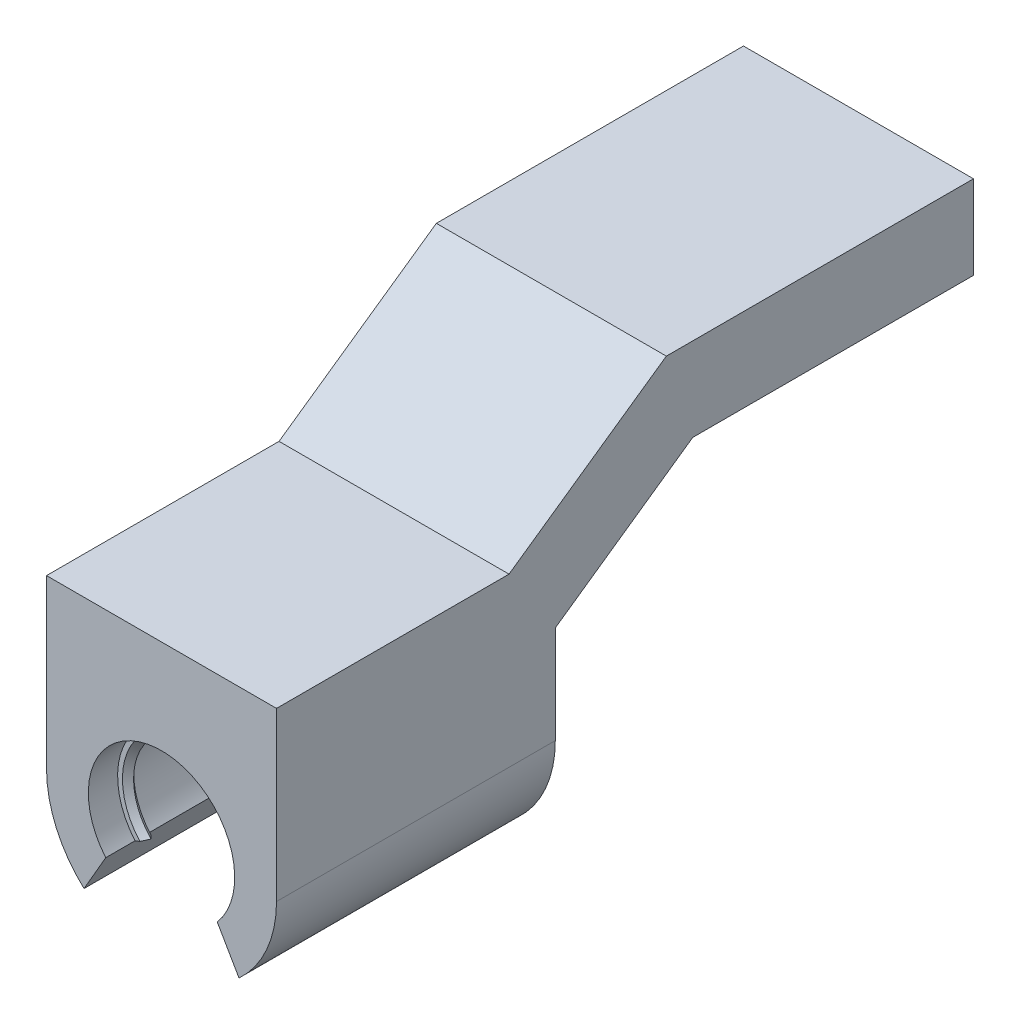
ISO-10303-21;
HEADER;
FILE_DESCRIPTION(('STEP AP214'),'2;1');
FILE_NAME('part.step','',(''),(''),'','','');
FILE_SCHEMA(('AUTOMOTIVE_DESIGN { 1 0 10303 214 1 1 1 1 }'));
ENDSEC;
DATA;
#1=APPLICATION_CONTEXT('core data for automotive mechanical design processes');
#2=APPLICATION_PROTOCOL_DEFINITION('international standard','automotive_design',2000,#1);
#3=PRODUCT_CONTEXT('',#1,'mechanical');
#4=PRODUCT('Part','Part','',(#3));
#5=PRODUCT_RELATED_PRODUCT_CATEGORY('part','',(#4));
#6=PRODUCT_DEFINITION_FORMATION('','',#4);
#7=PRODUCT_DEFINITION_CONTEXT('part definition',#1,'design');
#8=PRODUCT_DEFINITION('design','',#6,#7);
#9=PRODUCT_DEFINITION_SHAPE('','',#8);
#10=(LENGTH_UNIT() NAMED_UNIT(*) SI_UNIT(.MILLI.,.METRE.));
#11=(NAMED_UNIT(*) PLANE_ANGLE_UNIT() SI_UNIT($,.RADIAN.));
#12=(NAMED_UNIT(*) SI_UNIT($,.STERADIAN.) SOLID_ANGLE_UNIT());
#13=UNCERTAINTY_MEASURE_WITH_UNIT(LENGTH_MEASURE(1.E-05),#10,'distance_accuracy_value','');
#14=(GEOMETRIC_REPRESENTATION_CONTEXT(3) GLOBAL_UNCERTAINTY_ASSIGNED_CONTEXT((#13)) GLOBAL_UNIT_ASSIGNED_CONTEXT((#10,
#11,#12)) REPRESENTATION_CONTEXT('',''));
#15=CARTESIAN_POINT('',(0.,0.,0.));
#16=DIRECTION('',(0.,0.,1.));
#17=DIRECTION('',(1.,0.,0.));
#18=AXIS2_PLACEMENT_3D('',#15,#16,#17);
#19=CARTESIAN_POINT('',(0.,0.,20.));
#20=DIRECTION('',(0.,0.,-1.));
#21=DIRECTION('',(-1.,0.,0.));
#22=AXIS2_PLACEMENT_3D('',#19,#20,#21);
#23=CYLINDRICAL_SURFACE('',#22,5.25);
#24=DIRECTION('',(0.,0.,-1.));
#25=VECTOR('',#24,1.);
#26=CARTESIAN_POINT('',(-4.,-3.40036762718386,20.));
#27=LINE('',#26,#25);
#28=CARTESIAN_POINT('',(-4.,-3.40036762718386,20.));
#29=VERTEX_POINT('',#28);
#30=CARTESIAN_POINT('',(-4.,-3.40036762718386,17.9));
#31=VERTEX_POINT('',#30);
#32=EDGE_CURVE('E233',#29,#31,#27,.T.);
#33=ORIENTED_EDGE('',*,*,#32,.T.);
#34=CARTESIAN_POINT('',(0.,0.,17.9));
#35=DIRECTION('',(0.,0.,-1.));
#36=DIRECTION('',(-1.,0.,0.));
#37=AXIS2_PLACEMENT_3D('',#34,#35,#36);
#38=CIRCLE('',#37,5.25);
#39=CARTESIAN_POINT('',(4.,-3.40036762718386,17.9));
#40=VERTEX_POINT('',#39);
#41=EDGE_CURVE('E383',#31,#40,#38,.T.);
#42=ORIENTED_EDGE('',*,*,#41,.T.);
#43=DIRECTION('',(0.,0.,-1.));
#44=VECTOR('',#43,1.);
#45=CARTESIAN_POINT('',(4.,-3.40036762718386,20.));
#46=LINE('',#45,#44);
#47=CARTESIAN_POINT('',(4.,-3.40036762718386,20.));
#48=VERTEX_POINT('',#47);
#49=EDGE_CURVE('E255',#48,#40,#46,.T.);
#50=ORIENTED_EDGE('',*,*,#49,.F.);
#51=CARTESIAN_POINT('',(0.,0.,20.));
#52=DIRECTION('',(0.,0.,-1.));
#53=DIRECTION('',(1.,0.,0.));
#54=AXIS2_PLACEMENT_3D('',#51,#52,#53);
#55=CIRCLE('',#54,5.25);
#56=EDGE_CURVE('E232',#29,#48,#55,.T.);
#57=ORIENTED_EDGE('',*,*,#56,.F.);
#58=EDGE_LOOP('',(#33,#42,#50,#57));
#59=FACE_BOUND('',#58,.T.);
#60=ADVANCED_FACE('F33',(#59),#23,.F.);
#61=CARTESIAN_POINT('',(4.,-3.40036762718386,2.1));
#62=VERTEX_POINT('',#61);
#63=CARTESIAN_POINT('',(4.,-3.40036762718386,0.));
#64=VERTEX_POINT('',#63);
#65=EDGE_CURVE('E254',#62,#64,#46,.T.);
#66=ORIENTED_EDGE('',*,*,#65,.F.);
#67=CARTESIAN_POINT('',(0.,0.,2.1));
#68=DIRECTION('',(0.,0.,-1.));
#69=DIRECTION('',(-1.,0.,0.));
#70=AXIS2_PLACEMENT_3D('',#67,#68,#69);
#71=CIRCLE('',#70,5.25);
#72=CARTESIAN_POINT('',(-3.99999999999995,-3.40036762718392,2.1));
#73=VERTEX_POINT('',#72);
#74=EDGE_CURVE('E401',#73,#62,#71,.T.);
#75=ORIENTED_EDGE('',*,*,#74,.F.);
#76=CARTESIAN_POINT('',(-4.,-3.40036762718386,0.));
#77=VERTEX_POINT('',#76);
#78=EDGE_CURVE('E238',#73,#77,#27,.T.);
#79=ORIENTED_EDGE('',*,*,#78,.T.);
#80=CARTESIAN_POINT('',(0.,0.,0.));
#81=DIRECTION('',(0.,0.,-1.));
#82=DIRECTION('',(1.,0.,0.));
#83=AXIS2_PLACEMENT_3D('',#80,#81,#82);
#84=CIRCLE('',#83,5.25);
#85=EDGE_CURVE('E407',#77,#64,#84,.T.);
#86=ORIENTED_EDGE('',*,*,#85,.T.);
#87=EDGE_LOOP('',(#66,#75,#79,#86));
#88=FACE_BOUND('',#87,.T.);
#89=ADVANCED_FACE('F472',(#88),#23,.F.);
#90=CARTESIAN_POINT('',(4.,-3.40036762718386,17.1));
#91=VERTEX_POINT('',#90);
#92=CARTESIAN_POINT('',(4.,-3.40036762718386,2.9));
#93=VERTEX_POINT('',#92);
#94=EDGE_CURVE('E259',#91,#93,#46,.T.);
#95=ORIENTED_EDGE('',*,*,#94,.F.);
#96=CARTESIAN_POINT('',(0.,0.,17.1));
#97=DIRECTION('',(0.,0.,-1.));
#98=DIRECTION('',(-1.,0.,0.));
#99=AXIS2_PLACEMENT_3D('',#96,#97,#98);
#100=CIRCLE('',#99,5.25);
#101=CARTESIAN_POINT('',(-3.99999999999995,-3.40036762718392,17.1));
#102=VERTEX_POINT('',#101);
#103=EDGE_CURVE('E385',#102,#91,#100,.T.);
#104=ORIENTED_EDGE('',*,*,#103,.F.);
#105=CARTESIAN_POINT('',(-4.,-3.40036762718386,2.9));
#106=VERTEX_POINT('',#105);
#107=EDGE_CURVE('E237',#102,#106,#27,.T.);
#108=ORIENTED_EDGE('',*,*,#107,.T.);
#109=CARTESIAN_POINT('',(0.,0.,2.9));
#110=DIRECTION('',(0.,0.,-1.));
#111=DIRECTION('',(-1.,0.,0.));
#112=AXIS2_PLACEMENT_3D('',#109,#110,#111);
#113=CIRCLE('',#112,5.25);
#114=EDGE_CURVE('E404',#106,#93,#113,.T.);
#115=ORIENTED_EDGE('',*,*,#114,.T.);
#116=EDGE_LOOP('',(#95,#104,#108,#115));
#117=FACE_BOUND('',#116,.T.);
#118=ADVANCED_FACE('F276',(#117),#23,.F.);
#119=CARTESIAN_POINT('',(5.55720970410094,-6.097533952726,20.));
#120=DIRECTION('',(0.86602540378444,0.499999999999998,0.));
#121=DIRECTION('',(-0.499999999999998,0.86602540378444,0.));
#122=AXIS2_PLACEMENT_3D('',#119,#120,#121);
#123=PLANE('',#122);
#124=CARTESIAN_POINT('',(3.8157755224296,-3.0812814720341,17.9));
#125=CARTESIAN_POINT('',(3.7799287899026,-3.01919311001199,17.8330833661077));
#126=CARTESIAN_POINT('',(3.74402413241946,-2.95700441902284,17.766291720092));
#127=CARTESIAN_POINT('',(3.67209895830601,-2.8324263631151,17.6329583866945));
#128=CARTESIAN_POINT('',(3.63607844164595,-2.77003699814499,17.5664166993768));
#129=CARTESIAN_POINT('',(3.6,-2.70754730415631,17.5));
#130=B_SPLINE_CURVE_WITH_KNOTS('',3,(#124,#125,#126,#127,#128,#129),.UNSPECIFIED.,.F.,.F.,(4,2,
4),(0.,0.294209645050404,0.588419365651553),.UNSPECIFIED.);
#131=CARTESIAN_POINT('',(3.8157755224296,-3.0812814720341,17.9));
#132=VERTEX_POINT('',#131);
#133=CARTESIAN_POINT('',(3.6,-2.70754730415631,17.5));
#134=VERTEX_POINT('',#133);
#135=EDGE_CURVE('E284',#132,#134,#130,.T.);
#136=ORIENTED_EDGE('',*,*,#135,.T.);
#137=CARTESIAN_POINT('',(3.6,-2.70754730415631,17.5));
#138=CARTESIAN_POINT('',(3.63607844164595,-2.770036998145,17.4335833006232));
#139=CARTESIAN_POINT('',(3.67209895830601,-2.8324263631151,17.3670416133055));
#140=CARTESIAN_POINT('',(3.74402413241946,-2.95700441902284,17.233708279908));
#141=CARTESIAN_POINT('',(3.7799287899026,-3.01919311001199,17.1669166338923));
#142=CARTESIAN_POINT('',(3.81577552242961,-3.0812814720341,17.1));
#143=B_SPLINE_CURVE_WITH_KNOTS('',3,(#137,#138,#139,#140,#141,#142),.UNSPECIFIED.,.F.,.F.,(4,2,
4),(0.,0.29420972060115,0.588419365651559),.UNSPECIFIED.);
#144=CARTESIAN_POINT('',(3.8157755224296,-3.0812814720341,17.1));
#145=VERTEX_POINT('',#144);
#146=EDGE_CURVE('E289',#134,#145,#143,.T.);
#147=ORIENTED_EDGE('',*,*,#146,.T.);
#148=DIRECTION('',(0.499999999999998,-0.86602540378444,0.));
#149=VECTOR('',#148,1.);
#150=CARTESIAN_POINT('',(4.,-3.40036762718386,17.1));
#151=LINE('',#150,#149);
#152=EDGE_CURVE('E356',#145,#91,#151,.T.);
#153=ORIENTED_EDGE('',*,*,#152,.T.);
#154=ORIENTED_EDGE('',*,*,#94,.T.);
#155=DIRECTION('',(-0.499999999999998,0.86602540378444,0.));
#156=VECTOR('',#155,1.);
#157=CARTESIAN_POINT('',(4.,-3.40036762718386,2.9));
#158=LINE('',#157,#156);
#159=CARTESIAN_POINT('',(3.8157755224296,-3.0812814720341,2.9));
#160=VERTEX_POINT('',#159);
#161=EDGE_CURVE('E390',#93,#160,#158,.T.);
#162=ORIENTED_EDGE('',*,*,#161,.T.);
#163=CARTESIAN_POINT('',(3.8157755224296,-3.0812814720341,2.9));
#164=CARTESIAN_POINT('',(3.7799287899026,-3.01919311001199,2.83308336610767));
#165=CARTESIAN_POINT('',(3.74402413241946,-2.95700441902284,2.76629172009199));
#166=CARTESIAN_POINT('',(3.67209895830601,-2.8324263631151,2.63295838669446));
#167=CARTESIAN_POINT('',(3.63607844164595,-2.77003699814499,2.56641669937681));
#168=CARTESIAN_POINT('',(3.6,-2.70754730415631,2.5));
#169=B_SPLINE_CURVE_WITH_KNOTS('',3,(#163,#164,#165,#166,#167,#168),.UNSPECIFIED.,.F.,.F.,(4,2,
4),(0.,0.294209645050408,0.588419365651558),.UNSPECIFIED.);
#170=CARTESIAN_POINT('',(3.6,-2.70754730415631,2.5));
#171=VERTEX_POINT('',#170);
#172=EDGE_CURVE('E265',#160,#171,#169,.T.);
#173=ORIENTED_EDGE('',*,*,#172,.T.);
#174=CARTESIAN_POINT('',(3.6,-2.70754730415631,2.5));
#175=CARTESIAN_POINT('',(3.63607844164595,-2.770036998145,2.43358330062319));
#176=CARTESIAN_POINT('',(3.67209895830601,-2.83242636311511,2.36704161330554));
#177=CARTESIAN_POINT('',(3.74402413241946,-2.95700441902284,2.23370827990801));
#178=CARTESIAN_POINT('',(3.7799287899026,-3.019193110012,2.16691663389234));
#179=CARTESIAN_POINT('',(3.81577552242961,-3.0812814720341,2.1));
#180=B_SPLINE_CURVE_WITH_KNOTS('',3,(#174,#175,#176,#177,#178,#179),.UNSPECIFIED.,.F.,.F.,(4,2,
4),(0.,0.294209720601152,0.58841936565156),.UNSPECIFIED.);
#181=CARTESIAN_POINT('',(3.81577552242961,-3.0812814720341,2.1));
#182=VERTEX_POINT('',#181);
#183=EDGE_CURVE('E258',#171,#182,#180,.T.);
#184=ORIENTED_EDGE('',*,*,#183,.T.);
#185=DIRECTION('',(0.499999999999998,-0.86602540378444,0.));
#186=VECTOR('',#185,1.);
#187=CARTESIAN_POINT('',(4.,-3.40036762718386,2.1));
#188=LINE('',#187,#186);
#189=EDGE_CURVE('E388',#182,#62,#188,.T.);
#190=ORIENTED_EDGE('',*,*,#189,.T.);
#191=ORIENTED_EDGE('',*,*,#65,.T.);
#192=DIRECTION('',(0.499999999999998,-0.86602540378444,0.));
#193=VECTOR('',#192,1.);
#194=CARTESIAN_POINT('',(5.55720970410094,-6.097533952726,0.));
#195=LINE('',#194,#193);
#196=CARTESIAN_POINT('',(5.55720970410094,-6.097533952726,0.));
#197=VERTEX_POINT('',#196);
#198=EDGE_CURVE('E224',#64,#197,#195,.T.);
#199=ORIENTED_EDGE('',*,*,#198,.T.);
#200=DIRECTION('',(0.,0.,-1.));
#201=VECTOR('',#200,1.);
#202=CARTESIAN_POINT('',(5.55720970410094,-6.097533952726,20.));
#203=LINE('',#202,#201);
#204=CARTESIAN_POINT('',(5.55720970410094,-6.097533952726,20.));
#205=VERTEX_POINT('',#204);
#206=EDGE_CURVE('E251',#205,#197,#203,.T.);
#207=ORIENTED_EDGE('',*,*,#206,.F.);
#208=DIRECTION('',(0.499999999999998,-0.86602540378444,0.));
#209=VECTOR('',#208,1.);
#210=CARTESIAN_POINT('',(5.55720970410094,-6.097533952726,20.));
#211=LINE('',#210,#209);
#212=EDGE_CURVE('E410',#48,#205,#211,.T.);
#213=ORIENTED_EDGE('',*,*,#212,.F.);
#214=ORIENTED_EDGE('',*,*,#49,.T.);
#215=DIRECTION('',(-0.499999999999998,0.86602540378444,0.));
#216=VECTOR('',#215,1.);
#217=CARTESIAN_POINT('',(4.,-3.40036762718386,17.9));
#218=LINE('',#217,#216);
#219=EDGE_CURVE('E351',#40,#132,#218,.T.);
#220=ORIENTED_EDGE('',*,*,#219,.T.);
#221=EDGE_LOOP('',(#136,#147,#153,#154,#162,#173,#184,#190,#191,#199,#207,#213,#214,#220));
#222=FACE_BOUND('',#221,.T.);
#223=ADVANCED_FACE('F270',(#222),#123,.F.);
#224=CARTESIAN_POINT('',(0.,0.,20.));
#225=DIRECTION('',(0.,0.,-1.));
#226=DIRECTION('',(-1.,0.,0.));
#227=AXIS2_PLACEMENT_3D('',#224,#225,#226);
#228=CYLINDRICAL_SURFACE('',#227,8.25);
#229=CARTESIAN_POINT('',(0.,0.,0.));
#230=DIRECTION('',(0.,0.,1.));
#231=DIRECTION('',(1.,0.,0.));
#232=AXIS2_PLACEMENT_3D('',#229,#230,#231);
#233=CIRCLE('',#232,8.25);
#234=CARTESIAN_POINT('',(8.25,0.,0.));
#235=VERTEX_POINT('',#234);
#236=EDGE_CURVE('E220',#197,#235,#233,.T.);
#237=ORIENTED_EDGE('',*,*,#236,.T.);
#238=DIRECTION('',(0.,0.,-1.));
#239=VECTOR('',#238,1.);
#240=CARTESIAN_POINT('',(8.25,0.,20.));
#241=LINE('',#240,#239);
#242=CARTESIAN_POINT('',(8.25,0.,20.));
#243=VERTEX_POINT('',#242);
#244=EDGE_CURVE('E219',#243,#235,#241,.T.);
#245=ORIENTED_EDGE('',*,*,#244,.F.);
#246=CARTESIAN_POINT('',(0.,0.,20.));
#247=DIRECTION('',(0.,0.,1.));
#248=DIRECTION('',(1.,0.,0.));
#249=AXIS2_PLACEMENT_3D('',#246,#247,#248);
#250=CIRCLE('',#249,8.25);
#251=EDGE_CURVE('E412',#205,#243,#250,.T.);
#252=ORIENTED_EDGE('',*,*,#251,.F.);
#253=ORIENTED_EDGE('',*,*,#206,.T.);
#254=EDGE_LOOP('',(#237,#245,#252,#253));
#255=FACE_BOUND('',#254,.T.);
#256=ADVANCED_FACE('F275',(#255),#228,.T.);
#257=CARTESIAN_POINT('',(8.25,0.,20.));
#258=DIRECTION('',(-1.,0.,0.));
#259=DIRECTION('',(0.,0.,1.));
#260=AXIS2_PLACEMENT_3D('',#257,#258,#259);
#261=PLANE('',#260);
#262=DIRECTION('',(0.,0.573576436351047,-0.819152044288991));
#263=VECTOR('',#262,1.);
#264=CARTESIAN_POINT('',(8.25,12.,3.31994074001602));
#265=LINE('',#264,#263);
#266=CARTESIAN_POINT('',(8.25,12.,3.31994074001602));
#267=VERTEX_POINT('',#266);
#268=CARTESIAN_POINT('',(8.25,19.902466047274,-7.96595039374555));
#269=VERTEX_POINT('',#268);
#270=EDGE_CURVE('E201',#267,#269,#265,.T.);
#271=ORIENTED_EDGE('',*,*,#270,.F.);
#272=DIRECTION('',(0.,0.,-1.));
#273=VECTOR('',#272,1.);
#274=CARTESIAN_POINT('',(8.25,12.,20.));
#275=LINE('',#274,#273);
#276=CARTESIAN_POINT('',(8.25,12.,20.));
#277=VERTEX_POINT('',#276);
#278=EDGE_CURVE('E247',#277,#267,#275,.T.);
#279=ORIENTED_EDGE('',*,*,#278,.F.);
#280=DIRECTION('',(0.,1.,0.));
#281=VECTOR('',#280,1.);
#282=CARTESIAN_POINT('',(8.25,0.,20.));
#283=LINE('',#282,#281);
#284=EDGE_CURVE('E414',#243,#277,#283,.T.);
#285=ORIENTED_EDGE('',*,*,#284,.F.);
#286=ORIENTED_EDGE('',*,*,#244,.T.);
#287=DIRECTION('',(0.,1.,0.));
#288=VECTOR('',#287,1.);
#289=CARTESIAN_POINT('',(8.25,0.,0.));
#290=LINE('',#289,#288);
#291=CARTESIAN_POINT('',(8.25,7.,0.));
#292=VERTEX_POINT('',#291);
#293=EDGE_CURVE('E208',#235,#292,#290,.T.);
#294=ORIENTED_EDGE('',*,*,#293,.T.);
#295=DIRECTION('',(0.,-0.573576436351047,0.819152044288991));
#296=VECTOR('',#295,1.);
#297=CARTESIAN_POINT('',(8.25,13.902466047274,-9.85774312701946));
#298=LINE('',#297,#296);
#299=CARTESIAN_POINT('',(8.25,13.902466047274,-9.85774312701946));
#300=VERTEX_POINT('',#299);
#301=EDGE_CURVE('E191',#300,#292,#298,.T.);
#302=ORIENTED_EDGE('',*,*,#301,.F.);
#303=DIRECTION('',(0.,0.,1.));
#304=VECTOR('',#303,1.);
#305=CARTESIAN_POINT('',(8.25,13.902466047274,-30.));
#306=LINE('',#305,#304);
#307=CARTESIAN_POINT('',(8.25,13.902466047274,-30.));
#308=VERTEX_POINT('',#307);
#309=EDGE_CURVE('E212',#308,#300,#306,.T.);
#310=ORIENTED_EDGE('',*,*,#309,.F.);
#311=DIRECTION('',(0.,-1.,0.));
#312=VECTOR('',#311,1.);
#313=CARTESIAN_POINT('',(8.25,19.902466047274,-30.));
#314=LINE('',#313,#312);
#315=CARTESIAN_POINT('',(8.25,19.902466047274,-30.));
#316=VERTEX_POINT('',#315);
#317=EDGE_CURVE('E605',#316,#308,#314,.T.);
#318=ORIENTED_EDGE('',*,*,#317,.F.);
#319=DIRECTION('',(0.,0.,-1.));
#320=VECTOR('',#319,1.);
#321=CARTESIAN_POINT('',(8.25,19.902466047274,-7.96595039374555));
#322=LINE('',#321,#320);
#323=EDGE_CURVE('E603',#269,#316,#322,.T.);
#324=ORIENTED_EDGE('',*,*,#323,.F.);
#325=EDGE_LOOP('',(#271,#279,#285,#286,#294,#302,#310,#318,#324));
#326=FACE_BOUND('',#325,.T.);
#327=ADVANCED_FACE('F216',(#326),#261,.F.);
#328=CARTESIAN_POINT('',(-8.25,12.,20.));
#329=DIRECTION('',(0.,-1.,0.));
#330=DIRECTION('',(0.,0.,-1.));
#331=AXIS2_PLACEMENT_3D('',#328,#329,#330);
#332=PLANE('',#331);
#333=ORIENTED_EDGE('',*,*,#278,.T.);
#334=DIRECTION('',(-1.,0.,0.));
#335=VECTOR('',#334,1.);
#336=CARTESIAN_POINT('',(8.25,12.,3.31994074001602));
#337=LINE('',#336,#335);
#338=CARTESIAN_POINT('',(-8.25,12.,3.31994074001602));
#339=VERTEX_POINT('',#338);
#340=EDGE_CURVE('E211',#267,#339,#337,.T.);
#341=ORIENTED_EDGE('',*,*,#340,.T.);
#342=DIRECTION('',(0.,0.,-1.));
#343=VECTOR('',#342,1.);
#344=CARTESIAN_POINT('',(-8.25,12.,20.));
#345=LINE('',#344,#343);
#346=CARTESIAN_POINT('',(-8.25,12.,20.));
#347=VERTEX_POINT('',#346);
#348=EDGE_CURVE('E244',#347,#339,#345,.T.);
#349=ORIENTED_EDGE('',*,*,#348,.F.);
#350=DIRECTION('',(-1.,0.,0.));
#351=VECTOR('',#350,1.);
#352=CARTESIAN_POINT('',(-8.25,12.,20.));
#353=LINE('',#352,#351);
#354=EDGE_CURVE('E416',#277,#347,#353,.T.);
#355=ORIENTED_EDGE('',*,*,#354,.F.);
#356=EDGE_LOOP('',(#333,#341,#349,#355));
#357=FACE_BOUND('',#356,.T.);
#358=ADVANCED_FACE('F486',(#357),#332,.F.);
#359=CARTESIAN_POINT('',(-8.25,0.,20.));
#360=DIRECTION('',(1.,0.,0.));
#361=DIRECTION('',(0.,0.,-1.));
#362=AXIS2_PLACEMENT_3D('',#359,#360,#361);
#363=PLANE('',#362);
#364=ORIENTED_EDGE('',*,*,#348,.T.);
#365=DIRECTION('',(0.,0.573576436351047,-0.819152044288991));
#366=VECTOR('',#365,1.);
#367=CARTESIAN_POINT('',(-8.25,12.,3.31994074001602));
#368=LINE('',#367,#366);
#369=CARTESIAN_POINT('',(-8.25,19.902466047274,-7.96595039374555));
#370=VERTEX_POINT('',#369);
#371=EDGE_CURVE('E594',#339,#370,#368,.T.);
#372=ORIENTED_EDGE('',*,*,#371,.T.);
#373=DIRECTION('',(0.,0.,-1.));
#374=VECTOR('',#373,1.);
#375=CARTESIAN_POINT('',(-8.25,19.902466047274,-7.96595039374555));
#376=LINE('',#375,#374);
#377=CARTESIAN_POINT('',(-8.25,19.902466047274,-30.));
#378=VERTEX_POINT('',#377);
#379=EDGE_CURVE('E598',#370,#378,#376,.T.);
#380=ORIENTED_EDGE('',*,*,#379,.T.);
#381=DIRECTION('',(0.,-1.,0.));
#382=VECTOR('',#381,1.);
#383=CARTESIAN_POINT('',(-8.25,19.902466047274,-30.));
#384=LINE('',#383,#382);
#385=CARTESIAN_POINT('',(-8.25,13.902466047274,-30.));
#386=VERTEX_POINT('',#385);
#387=EDGE_CURVE('E612',#378,#386,#384,.T.);
#388=ORIENTED_EDGE('',*,*,#387,.T.);
#389=DIRECTION('',(0.,0.,1.));
#390=VECTOR('',#389,1.);
#391=CARTESIAN_POINT('',(-8.25,13.902466047274,-30.));
#392=LINE('',#391,#390);
#393=CARTESIAN_POINT('',(-8.25,13.902466047274,-9.85774312701946));
#394=VERTEX_POINT('',#393);
#395=EDGE_CURVE('E202',#386,#394,#392,.T.);
#396=ORIENTED_EDGE('',*,*,#395,.T.);
#397=DIRECTION('',(0.,-0.573576436351047,0.819152044288991));
#398=VECTOR('',#397,1.);
#399=CARTESIAN_POINT('',(-8.25,13.902466047274,-9.85774312701946));
#400=LINE('',#399,#398);
#401=CARTESIAN_POINT('',(-8.25,7.,0.));
#402=VERTEX_POINT('',#401);
#403=EDGE_CURVE('E51',#394,#402,#400,.T.);
#404=ORIENTED_EDGE('',*,*,#403,.T.);
#405=DIRECTION('',(0.,-1.,0.));
#406=VECTOR('',#405,1.);
#407=CARTESIAN_POINT('',(-8.25,0.,0.));
#408=LINE('',#407,#406);
#409=CARTESIAN_POINT('',(-8.25,0.,0.));
#410=VERTEX_POINT('',#409);
#411=EDGE_CURVE('E210',#402,#410,#408,.T.);
#412=ORIENTED_EDGE('',*,*,#411,.T.);
#413=DIRECTION('',(0.,0.,-1.));
#414=VECTOR('',#413,1.);
#415=CARTESIAN_POINT('',(-8.25,0.,20.));
#416=LINE('',#415,#414);
#417=CARTESIAN_POINT('',(-8.25,0.,20.));
#418=VERTEX_POINT('',#417);
#419=EDGE_CURVE('E241',#418,#410,#416,.T.);
#420=ORIENTED_EDGE('',*,*,#419,.F.);
#421=DIRECTION('',(0.,-1.,0.));
#422=VECTOR('',#421,1.);
#423=CARTESIAN_POINT('',(-8.25,0.,20.));
#424=LINE('',#423,#422);
#425=EDGE_CURVE('E418',#347,#418,#424,.T.);
#426=ORIENTED_EDGE('',*,*,#425,.F.);
#427=EDGE_LOOP('',(#364,#372,#380,#388,#396,#404,#412,#420,#426));
#428=FACE_BOUND('',#427,.T.);
#429=ADVANCED_FACE('F483',(#428),#363,.F.);
#430=CARTESIAN_POINT('',(0.,0.,20.));
#431=DIRECTION('',(0.,0.,-1.));
#432=DIRECTION('',(-1.,0.,0.));
#433=AXIS2_PLACEMENT_3D('',#430,#431,#432);
#434=CYLINDRICAL_SURFACE('',#433,8.25);
#435=CARTESIAN_POINT('',(0.,0.,0.));
#436=DIRECTION('',(0.,0.,1.));
#437=DIRECTION('',(1.,0.,0.));
#438=AXIS2_PLACEMENT_3D('',#435,#436,#437);
#439=CIRCLE('',#438,8.25);
#440=CARTESIAN_POINT('',(-5.55720970410094,-6.097533952726,0.));
#441=VERTEX_POINT('',#440);
#442=EDGE_CURVE('E222',#410,#441,#439,.T.);
#443=ORIENTED_EDGE('',*,*,#442,.T.);
#444=DIRECTION('',(0.,0.,-1.));
#445=VECTOR('',#444,1.);
#446=CARTESIAN_POINT('',(-5.55720970410094,-6.097533952726,20.));
#447=LINE('',#446,#445);
#448=CARTESIAN_POINT('',(-5.55720970410094,-6.097533952726,20.));
#449=VERTEX_POINT('',#448);
#450=EDGE_CURVE('E236',#449,#441,#447,.T.);
#451=ORIENTED_EDGE('',*,*,#450,.F.);
#452=CARTESIAN_POINT('',(0.,0.,20.));
#453=DIRECTION('',(0.,0.,1.));
#454=DIRECTION('',(1.,0.,0.));
#455=AXIS2_PLACEMENT_3D('',#452,#453,#454);
#456=CIRCLE('',#455,8.25);
#457=EDGE_CURVE('E420',#418,#449,#456,.T.);
#458=ORIENTED_EDGE('',*,*,#457,.F.);
#459=ORIENTED_EDGE('',*,*,#419,.T.);
#460=EDGE_LOOP('',(#443,#451,#458,#459));
#461=FACE_BOUND('',#460,.T.);
#462=ADVANCED_FACE('F475',(#461),#434,.T.);
#463=CARTESIAN_POINT('',(-4.,-3.40036762718386,20.));
#464=DIRECTION('',(-0.86602540378444,0.499999999999998,0.));
#465=DIRECTION('',(-0.499999999999998,-0.86602540378444,0.));
#466=AXIS2_PLACEMENT_3D('',#463,#464,#465);
#467=PLANE('',#466);
#468=DIRECTION('',(0.499999999999998,0.86602540378444,0.));
#469=VECTOR('',#468,1.);
#470=CARTESIAN_POINT('',(-4.,-3.40036762718386,0.));
#471=LINE('',#470,#469);
#472=EDGE_CURVE('E229',#441,#77,#471,.T.);
#473=ORIENTED_EDGE('',*,*,#472,.T.);
#474=ORIENTED_EDGE('',*,*,#78,.F.);
#475=DIRECTION('',(0.,0.,1.));
#476=VECTOR('',#475,1.);
#477=CARTESIAN_POINT('',(-3.99999999999995,-3.40036762718392,2.1));
#478=LINE('',#477,#476);
#479=EDGE_CURVE('E395',#73,#106,#478,.T.);
#480=ORIENTED_EDGE('',*,*,#479,.T.);
#481=ORIENTED_EDGE('',*,*,#107,.F.);
#482=DIRECTION('',(0.,0.,1.));
#483=VECTOR('',#482,1.);
#484=CARTESIAN_POINT('',(-3.99999999999995,-3.40036762718392,17.9));
#485=LINE('',#484,#483);
#486=EDGE_CURVE('E381',#102,#31,#485,.T.);
#487=ORIENTED_EDGE('',*,*,#486,.T.);
#488=ORIENTED_EDGE('',*,*,#32,.F.);
#489=DIRECTION('',(0.499999999999998,0.86602540378444,0.));
#490=VECTOR('',#489,1.);
#491=CARTESIAN_POINT('',(-4.,-3.40036762718386,20.));
#492=LINE('',#491,#490);
#493=EDGE_CURVE('E422',#449,#29,#492,.T.);
#494=ORIENTED_EDGE('',*,*,#493,.F.);
#495=ORIENTED_EDGE('',*,*,#450,.T.);
#496=EDGE_LOOP('',(#473,#474,#480,#481,#487,#488,#494,#495));
#497=FACE_BOUND('',#496,.T.);
#498=ADVANCED_FACE('F468',(#497),#467,.F.);
#499=CARTESIAN_POINT('',(0.,0.,20.));
#500=DIRECTION('',(0.,0.,1.));
#501=DIRECTION('',(1.,0.,0.));
#502=AXIS2_PLACEMENT_3D('',#499,#500,#501);
#503=PLANE('',#502);
#504=ORIENTED_EDGE('',*,*,#56,.T.);
#505=ORIENTED_EDGE('',*,*,#212,.T.);
#506=ORIENTED_EDGE('',*,*,#251,.T.);
#507=ORIENTED_EDGE('',*,*,#284,.T.);
#508=ORIENTED_EDGE('',*,*,#354,.T.);
#509=ORIENTED_EDGE('',*,*,#425,.T.);
#510=ORIENTED_EDGE('',*,*,#457,.T.);
#511=ORIENTED_EDGE('',*,*,#493,.T.);
#512=EDGE_LOOP('',(#504,#505,#506,#507,#508,#509,#510,#511));
#513=FACE_BOUND('',#512,.T.);
#514=ADVANCED_FACE('F432',(#513),#503,.T.);
#515=CARTESIAN_POINT('',(0.,0.,0.));
#516=DIRECTION('',(0.,0.,1.));
#517=DIRECTION('',(1.,0.,0.));
#518=AXIS2_PLACEMENT_3D('',#515,#516,#517);
#519=PLANE('',#518);
#520=ORIENTED_EDGE('',*,*,#411,.F.);
#521=DIRECTION('',(-1.,0.,0.));
#522=VECTOR('',#521,1.);
#523=CARTESIAN_POINT('',(8.25,7.,0.));
#524=LINE('',#523,#522);
#525=EDGE_CURVE('E194',#292,#402,#524,.T.);
#526=ORIENTED_EDGE('',*,*,#525,.F.);
#527=ORIENTED_EDGE('',*,*,#293,.F.);
#528=ORIENTED_EDGE('',*,*,#236,.F.);
#529=ORIENTED_EDGE('',*,*,#198,.F.);
#530=ORIENTED_EDGE('',*,*,#85,.F.);
#531=ORIENTED_EDGE('',*,*,#472,.F.);
#532=ORIENTED_EDGE('',*,*,#442,.F.);
#533=EDGE_LOOP('',(#520,#526,#527,#528,#529,#530,#531,#532));
#534=FACE_BOUND('',#533,.T.);
#535=ADVANCED_FACE('F206',(#534),#519,.F.);
#536=CARTESIAN_POINT('',(-3.99999999999995,-3.40036762718392,2.1));
#537=DIRECTION('',(0.,0.,-1.));
#538=DIRECTION('',(-1.,0.,0.));
#539=AXIS2_PLACEMENT_3D('',#536,#537,#538);
#540=PLANE('',#539);
#541=ORIENTED_EDGE('',*,*,#189,.F.);
#542=CARTESIAN_POINT('',(0.,0.,2.1));
#543=DIRECTION('',(0.,0.,-1.));
#544=DIRECTION('',(-1.,0.,0.));
#545=AXIS2_PLACEMENT_3D('',#542,#543,#544);
#546=CIRCLE('',#545,4.9045324290368);
#547=CARTESIAN_POINT('',(-3.6554166720272,-3.2699185465909,2.1));
#548=VERTEX_POINT('',#547);
#549=EDGE_CURVE('E11',#182,#548,#546,.F.);
#550=ORIENTED_EDGE('',*,*,#549,.T.);
#551=DIRECTION('',(-0.935226774740295,-0.354049261839176,0.));
#552=VECTOR('',#551,1.);
#553=CARTESIAN_POINT('',(-3.99999999999995,-3.40036762718392,2.1));
#554=LINE('',#553,#552);
#555=EDGE_CURVE('E393',#548,#73,#554,.T.);
#556=ORIENTED_EDGE('',*,*,#555,.T.);
#557=ORIENTED_EDGE('',*,*,#74,.T.);
#558=EDGE_LOOP('',(#541,#550,#556,#557));
#559=FACE_BOUND('',#558,.T.);
#560=ADVANCED_FACE('F337',(#559),#540,.T.);
#561=CARTESIAN_POINT('',(-3.99999999999995,-3.40036762718392,2.9));
#562=DIRECTION('',(0.,0.,1.));
#563=DIRECTION('',(1.,0.,0.));
#564=AXIS2_PLACEMENT_3D('',#561,#562,#563);
#565=PLANE('',#564);
#566=DIRECTION('',(0.935226774740295,0.354049261839176,0.));
#567=VECTOR('',#566,1.);
#568=CARTESIAN_POINT('',(-3.99999999999995,-3.40036762718392,2.9));
#569=LINE('',#568,#567);
#570=CARTESIAN_POINT('',(-3.6554166720272,-3.2699185465909,2.9));
#571=VERTEX_POINT('',#570);
#572=EDGE_CURVE('E398',#106,#571,#569,.T.);
#573=ORIENTED_EDGE('',*,*,#572,.T.);
#574=CARTESIAN_POINT('',(0.,0.,2.9));
#575=DIRECTION('',(0.,0.,1.));
#576=DIRECTION('',(1.,0.,0.));
#577=AXIS2_PLACEMENT_3D('',#574,#575,#576);
#578=CIRCLE('',#577,4.90453242903679);
#579=EDGE_CURVE('E444',#571,#160,#578,.F.);
#580=ORIENTED_EDGE('',*,*,#579,.T.);
#581=ORIENTED_EDGE('',*,*,#161,.F.);
#582=ORIENTED_EDGE('',*,*,#114,.F.);
#583=EDGE_LOOP('',(#573,#580,#581,#582));
#584=FACE_BOUND('',#583,.T.);
#585=ADVANCED_FACE('F336',(#584),#565,.T.);
#586=CARTESIAN_POINT('',(0.624513795582286,-1.64966315644671,0.));
#587=DIRECTION('',(0.354049261839176,-0.935226774740295,0.));
#588=DIRECTION('',(0.935226774740295,0.354049261839176,0.));
#589=AXIS2_PLACEMENT_3D('',#586,#587,#588);
#590=PLANE('',#589);
#591=CARTESIAN_POINT('',(-3.6554166720272,-3.26991854659091,2.1));
#592=CARTESIAN_POINT('',(-3.58836702393478,-3.24453552820984,2.16691663389234));
#593=CARTESIAN_POINT('',(-3.52120902990256,-3.21911149325285,2.23370827990802));
#594=CARTESIAN_POINT('',(-3.38667633268504,-3.16818138364781,2.36704161330554));
#595=CARTESIAN_POINT('',(-3.3193016294441,-3.14267530897869,2.43358330062319));
#596=CARTESIAN_POINT('',(-3.25181858020772,-3.11712821771258,2.5));
#597=B_SPLINE_CURVE_WITH_KNOTS('',3,(#591,#592,#593,#594,#595,#596),.UNSPECIFIED.,.F.,.F.,(4,2,
4),(0.,0.294209645050409,0.58841936565156),.UNSPECIFIED.);
#598=CARTESIAN_POINT('',(-3.25181858020772,-3.11712821771258,2.5));
#599=VERTEX_POINT('',#598);
#600=EDGE_CURVE('E59',#548,#599,#597,.T.);
#601=ORIENTED_EDGE('',*,*,#600,.T.);
#602=CARTESIAN_POINT('',(-3.25181858020772,-3.11712821771258,2.5));
#603=CARTESIAN_POINT('',(-3.3193016294441,-3.14267530897869,2.56641669937681));
#604=CARTESIAN_POINT('',(-3.38667633268504,-3.16818138364781,2.63295838669446));
#605=CARTESIAN_POINT('',(-3.52120902990256,-3.21911149325285,2.76629172009199));
#606=CARTESIAN_POINT('',(-3.58836702393478,-3.24453552820984,2.83308336610767));
#607=CARTESIAN_POINT('',(-3.6554166720272,-3.2699185465909,2.9));
#608=B_SPLINE_CURVE_WITH_KNOTS('',3,(#602,#603,#604,#605,#606,#607),.UNSPECIFIED.,.F.,.F.,(4,2,
4),(0.,0.294209720601151,0.588419365651559),.UNSPECIFIED.);
#609=EDGE_CURVE('E43',#599,#571,#608,.T.);
#610=ORIENTED_EDGE('',*,*,#609,.T.);
#611=ORIENTED_EDGE('',*,*,#572,.F.);
#612=ORIENTED_EDGE('',*,*,#479,.F.);
#613=ORIENTED_EDGE('',*,*,#555,.F.);
#614=EDGE_LOOP('',(#601,#610,#611,#612,#613));
#615=FACE_BOUND('',#614,.T.);
#616=ADVANCED_FACE('F328',(#615),#590,.T.);
#617=CARTESIAN_POINT('',(-3.99999999999995,-3.40036762718392,17.9));
#618=DIRECTION('',(0.,0.,1.));
#619=DIRECTION('',(1.,0.,0.));
#620=AXIS2_PLACEMENT_3D('',#617,#618,#619);
#621=PLANE('',#620);
#622=DIRECTION('',(0.935226774740295,0.354049261839176,0.));
#623=VECTOR('',#622,1.);
#624=CARTESIAN_POINT('',(-3.99999999999995,-3.40036762718392,17.9));
#625=LINE('',#624,#623);
#626=CARTESIAN_POINT('',(-3.65541667202719,-3.2699185465909,17.9));
#627=VERTEX_POINT('',#626);
#628=EDGE_CURVE('E376',#31,#627,#625,.T.);
#629=ORIENTED_EDGE('',*,*,#628,.T.);
#630=CARTESIAN_POINT('',(0.,0.,17.9));
#631=DIRECTION('',(0.,0.,1.));
#632=DIRECTION('',(1.,0.,0.));
#633=AXIS2_PLACEMENT_3D('',#630,#631,#632);
#634=CIRCLE('',#633,4.90453242903679);
#635=EDGE_CURVE('E442',#627,#132,#634,.F.);
#636=ORIENTED_EDGE('',*,*,#635,.T.);
#637=ORIENTED_EDGE('',*,*,#219,.F.);
#638=ORIENTED_EDGE('',*,*,#41,.F.);
#639=EDGE_LOOP('',(#629,#636,#637,#638));
#640=FACE_BOUND('',#639,.T.);
#641=ADVANCED_FACE('F324',(#640),#621,.T.);
#642=CARTESIAN_POINT('',(-3.99999999999995,-3.40036762718392,17.1));
#643=DIRECTION('',(0.,0.,-1.));
#644=DIRECTION('',(-1.,0.,0.));
#645=AXIS2_PLACEMENT_3D('',#642,#643,#644);
#646=PLANE('',#645);
#647=ORIENTED_EDGE('',*,*,#152,.F.);
#648=CARTESIAN_POINT('',(0.,0.,17.1));
#649=DIRECTION('',(0.,0.,-1.));
#650=DIRECTION('',(-1.,0.,0.));
#651=AXIS2_PLACEMENT_3D('',#648,#649,#650);
#652=CIRCLE('',#651,4.90453242903679);
#653=CARTESIAN_POINT('',(-3.6554166720272,-3.2699185465909,17.1));
#654=VERTEX_POINT('',#653);
#655=EDGE_CURVE('E312',#145,#654,#652,.F.);
#656=ORIENTED_EDGE('',*,*,#655,.T.);
#657=DIRECTION('',(-0.935226774740295,-0.354049261839176,0.));
#658=VECTOR('',#657,1.);
#659=CARTESIAN_POINT('',(-3.99999999999995,-3.40036762718392,17.1));
#660=LINE('',#659,#658);
#661=EDGE_CURVE('E379',#654,#102,#660,.T.);
#662=ORIENTED_EDGE('',*,*,#661,.T.);
#663=ORIENTED_EDGE('',*,*,#103,.T.);
#664=EDGE_LOOP('',(#647,#656,#662,#663));
#665=FACE_BOUND('',#664,.T.);
#666=ADVANCED_FACE('F321',(#665),#646,.T.);
#667=CARTESIAN_POINT('',(0.624513795582286,-1.64966315644671,0.));
#668=DIRECTION('',(-0.354049261839176,0.935226774740295,0.));
#669=DIRECTION('',(-0.935226774740295,-0.354049261839176,0.));
#670=AXIS2_PLACEMENT_3D('',#667,#668,#669);
#671=PLANE('',#670);
#672=ORIENTED_EDGE('',*,*,#661,.F.);
#673=CARTESIAN_POINT('',(-3.6554166720272,-3.2699185465909,17.1));
#674=CARTESIAN_POINT('',(-3.58836702393478,-3.24453552820984,17.1669166338923));
#675=CARTESIAN_POINT('',(-3.52120902990256,-3.21911149325285,17.233708279908));
#676=CARTESIAN_POINT('',(-3.38667633268504,-3.16818138364781,17.3670416133055));
#677=CARTESIAN_POINT('',(-3.3193016294441,-3.14267530897869,17.4335833006232));
#678=CARTESIAN_POINT('',(-3.25181858020772,-3.11712821771258,17.5));
#679=B_SPLINE_CURVE_WITH_KNOTS('',3,(#673,#674,#675,#676,#677,#678),.UNSPECIFIED.,.F.,.F.,(4,2,
4),(0.,0.294209645050409,0.588419365651559),.UNSPECIFIED.);
#680=CARTESIAN_POINT('',(-3.25181858020772,-3.11712821771258,17.5));
#681=VERTEX_POINT('',#680);
#682=EDGE_CURVE('E311',#654,#681,#679,.T.);
#683=ORIENTED_EDGE('',*,*,#682,.T.);
#684=CARTESIAN_POINT('',(-3.25181858020772,-3.11712821771258,17.5));
#685=CARTESIAN_POINT('',(-3.3193016294441,-3.14267530897869,17.5664166993768));
#686=CARTESIAN_POINT('',(-3.38667633268504,-3.16818138364781,17.6329583866945));
#687=CARTESIAN_POINT('',(-3.52120902990256,-3.21911149325285,17.766291720092));
#688=CARTESIAN_POINT('',(-3.58836702393477,-3.24453552820984,17.8330833661077));
#689=CARTESIAN_POINT('',(-3.65541667202719,-3.2699185465909,17.9));
#690=B_SPLINE_CURVE_WITH_KNOTS('',3,(#684,#685,#686,#687,#688,#689),.UNSPECIFIED.,.F.,.F.,(4,2,
4),(0.,0.29420972060115,0.588419365651553),.UNSPECIFIED.);
#691=EDGE_CURVE('E305',#681,#627,#690,.T.);
#692=ORIENTED_EDGE('',*,*,#691,.T.);
#693=ORIENTED_EDGE('',*,*,#628,.F.);
#694=ORIENTED_EDGE('',*,*,#486,.F.);
#695=EDGE_LOOP('',(#672,#683,#692,#693,#694));
#696=FACE_BOUND('',#695,.T.);
#697=ADVANCED_FACE('F298',(#696),#671,.F.);
#698=CARTESIAN_POINT('',(0.,0.,17.9));
#699=DIRECTION('',(0.,0.,1.));
#700=DIRECTION('',(1.,0.,0.));
#701=AXIS2_PLACEMENT_3D('',#698,#699,#700);
#702=CONICAL_SURFACE('',#701,4.90453242903679,0.785398163397445);
#703=ORIENTED_EDGE('',*,*,#635,.F.);
#704=ORIENTED_EDGE('',*,*,#691,.F.);
#705=CARTESIAN_POINT('',(0.,0.,17.5));
#706=DIRECTION('',(0.,0.,1.));
#707=DIRECTION('',(1.,0.,0.));
#708=AXIS2_PLACEMENT_3D('',#705,#706,#707);
#709=CIRCLE('',#708,4.50453242903679);
#710=EDGE_CURVE('E349',#134,#681,#709,.T.);
#711=ORIENTED_EDGE('',*,*,#710,.F.);
#712=ORIENTED_EDGE('',*,*,#135,.F.);
#713=EDGE_LOOP('',(#703,#704,#711,#712));
#714=FACE_BOUND('',#713,.T.);
#715=ADVANCED_FACE('F294',(#714),#702,.F.);
#716=CARTESIAN_POINT('',(0.,0.,17.5));
#717=DIRECTION('',(0.,0.,-1.));
#718=DIRECTION('',(-1.,0.,0.));
#719=AXIS2_PLACEMENT_3D('',#716,#717,#718);
#720=CONICAL_SURFACE('',#719,4.50453242903679,0.785398163397446);
#721=ORIENTED_EDGE('',*,*,#682,.F.);
#722=ORIENTED_EDGE('',*,*,#655,.F.);
#723=ORIENTED_EDGE('',*,*,#146,.F.);
#724=ORIENTED_EDGE('',*,*,#710,.T.);
#725=EDGE_LOOP('',(#721,#722,#723,#724));
#726=FACE_BOUND('',#725,.T.);
#727=ADVANCED_FACE('F297',(#726),#720,.F.);
#728=CARTESIAN_POINT('',(0.,0.,2.5));
#729=DIRECTION('',(0.,0.,-1.));
#730=DIRECTION('',(-1.,0.,0.));
#731=AXIS2_PLACEMENT_3D('',#728,#729,#730);
#732=CONICAL_SURFACE('',#731,4.50453242903679,0.785398163397451);
#733=CARTESIAN_POINT('',(0.,0.,2.5));
#734=DIRECTION('',(0.,0.,-1.));
#735=DIRECTION('',(-1.,0.,0.));
#736=AXIS2_PLACEMENT_3D('',#733,#734,#735);
#737=CIRCLE('',#736,4.50453242903679);
#738=EDGE_CURVE('E38',#599,#171,#737,.T.);
#739=ORIENTED_EDGE('',*,*,#738,.F.);
#740=ORIENTED_EDGE('',*,*,#600,.F.);
#741=ORIENTED_EDGE('',*,*,#549,.F.);
#742=ORIENTED_EDGE('',*,*,#183,.F.);
#743=EDGE_LOOP('',(#739,#740,#741,#742));
#744=FACE_BOUND('',#743,.T.);
#745=ADVANCED_FACE('F35',(#744),#732,.F.);
#746=CARTESIAN_POINT('',(0.,0.,2.9));
#747=DIRECTION('',(0.,0.,1.));
#748=DIRECTION('',(1.,0.,0.));
#749=AXIS2_PLACEMENT_3D('',#746,#747,#748);
#750=CONICAL_SURFACE('',#749,4.90453242903679,0.785398163397445);
#751=ORIENTED_EDGE('',*,*,#609,.F.);
#752=ORIENTED_EDGE('',*,*,#738,.T.);
#753=ORIENTED_EDGE('',*,*,#172,.F.);
#754=ORIENTED_EDGE('',*,*,#579,.F.);
#755=EDGE_LOOP('',(#751,#752,#753,#754));
#756=FACE_BOUND('',#755,.T.);
#757=ADVANCED_FACE('F301',(#756),#750,.F.);
#758=CARTESIAN_POINT('',(8.25,13.902466047274,-9.85774312701946));
#759=DIRECTION('',(0.,-0.819152044288991,-0.573576436351047));
#760=DIRECTION('',(0.,0.573576436351047,-0.819152044288991));
#761=AXIS2_PLACEMENT_3D('',#758,#759,#760);
#762=PLANE('',#761);
#763=ORIENTED_EDGE('',*,*,#403,.F.);
#764=DIRECTION('',(-1.,0.,0.));
#765=VECTOR('',#764,1.);
#766=CARTESIAN_POINT('',(8.25,13.902466047274,-9.85774312701946));
#767=LINE('',#766,#765);
#768=EDGE_CURVE('E196',#300,#394,#767,.T.);
#769=ORIENTED_EDGE('',*,*,#768,.F.);
#770=ORIENTED_EDGE('',*,*,#301,.T.);
#771=ORIENTED_EDGE('',*,*,#525,.T.);
#772=EDGE_LOOP('',(#763,#769,#770,#771));
#773=FACE_BOUND('',#772,.T.);
#774=ADVANCED_FACE('F193',(#773),#762,.T.);
#775=CARTESIAN_POINT('',(8.25,13.902466047274,-30.));
#776=DIRECTION('',(0.,-1.,0.));
#777=DIRECTION('',(0.,0.,-1.));
#778=AXIS2_PLACEMENT_3D('',#775,#776,#777);
#779=PLANE('',#778);
#780=ORIENTED_EDGE('',*,*,#395,.F.);
#781=DIRECTION('',(-1.,0.,0.));
#782=VECTOR('',#781,1.);
#783=CARTESIAN_POINT('',(8.25,13.902466047274,-30.));
#784=LINE('',#783,#782);
#785=EDGE_CURVE('E361',#308,#386,#784,.T.);
#786=ORIENTED_EDGE('',*,*,#785,.F.);
#787=ORIENTED_EDGE('',*,*,#309,.T.);
#788=ORIENTED_EDGE('',*,*,#768,.T.);
#789=EDGE_LOOP('',(#780,#786,#787,#788));
#790=FACE_BOUND('',#789,.T.);
#791=ADVANCED_FACE('F553',(#790),#779,.T.);
#792=CARTESIAN_POINT('',(8.25,19.902466047274,-30.));
#793=DIRECTION('',(0.,0.,-1.));
#794=DIRECTION('',(-1.,0.,0.));
#795=AXIS2_PLACEMENT_3D('',#792,#793,#794);
#796=PLANE('',#795);
#797=ORIENTED_EDGE('',*,*,#387,.F.);
#798=DIRECTION('',(-1.,0.,0.));
#799=VECTOR('',#798,1.);
#800=CARTESIAN_POINT('',(8.25,19.902466047274,-30.));
#801=LINE('',#800,#799);
#802=EDGE_CURVE('E365',#316,#378,#801,.T.);
#803=ORIENTED_EDGE('',*,*,#802,.F.);
#804=ORIENTED_EDGE('',*,*,#317,.T.);
#805=ORIENTED_EDGE('',*,*,#785,.T.);
#806=EDGE_LOOP('',(#797,#803,#804,#805));
#807=FACE_BOUND('',#806,.T.);
#808=ADVANCED_FACE('F562',(#807),#796,.T.);
#809=CARTESIAN_POINT('',(8.25,19.902466047274,-7.96595039374555));
#810=DIRECTION('',(0.,1.,0.));
#811=DIRECTION('',(0.,0.,1.));
#812=AXIS2_PLACEMENT_3D('',#809,#810,#811);
#813=PLANE('',#812);
#814=ORIENTED_EDGE('',*,*,#379,.F.);
#815=DIRECTION('',(-1.,0.,0.));
#816=VECTOR('',#815,1.);
#817=CARTESIAN_POINT('',(8.25,19.902466047274,-7.96595039374555));
#818=LINE('',#817,#816);
#819=EDGE_CURVE('E371',#269,#370,#818,.T.);
#820=ORIENTED_EDGE('',*,*,#819,.F.);
#821=ORIENTED_EDGE('',*,*,#323,.T.);
#822=ORIENTED_EDGE('',*,*,#802,.T.);
#823=EDGE_LOOP('',(#814,#820,#821,#822));
#824=FACE_BOUND('',#823,.T.);
#825=ADVANCED_FACE('F571',(#824),#813,.T.);
#826=CARTESIAN_POINT('',(8.25,12.,3.31994074001602));
#827=DIRECTION('',(0.,0.819152044288991,0.573576436351047));
#828=DIRECTION('',(0.,-0.573576436351047,0.819152044288991));
#829=AXIS2_PLACEMENT_3D('',#826,#827,#828);
#830=PLANE('',#829);
#831=ORIENTED_EDGE('',*,*,#371,.F.);
#832=ORIENTED_EDGE('',*,*,#340,.F.);
#833=ORIENTED_EDGE('',*,*,#270,.T.);
#834=ORIENTED_EDGE('',*,*,#819,.T.);
#835=EDGE_LOOP('',(#831,#832,#833,#834));
#836=FACE_BOUND('',#835,.T.);
#837=ADVANCED_FACE('F581',(#836),#830,.T.);
#838=CLOSED_SHELL('',(#60,#89,#118,#223,#256,#327,#358,#429,#462,#498,#514,#535,#560,#585,#616,
#641,#666,#697,#715,#727,#745,#757,#774,#791,#808,#825,#837));
#839=MANIFOLD_SOLID_BREP('B2',#838);
#840=ADVANCED_BREP_SHAPE_REPRESENTATION('',(#18,#839),#14);
#841=SHAPE_DEFINITION_REPRESENTATION(#9,#840);
ENDSEC;
END-ISO-10303-21;
